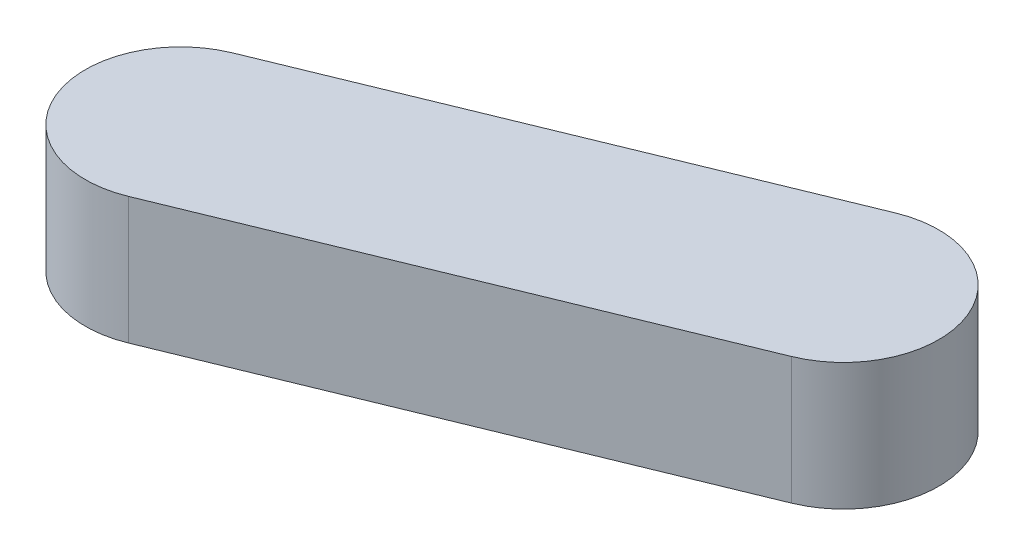
ISO-10303-21;
HEADER;
FILE_DESCRIPTION(('STEP AP214'),'2;1');
FILE_NAME('part.step','',(''),(''),'','','');
FILE_SCHEMA(('AUTOMOTIVE_DESIGN { 1 0 10303 214 1 1 1 1 }'));
ENDSEC;
DATA;
#1=APPLICATION_CONTEXT('core data for automotive mechanical design processes');
#2=APPLICATION_PROTOCOL_DEFINITION('international standard','automotive_design',2000,#1);
#3=PRODUCT_CONTEXT('',#1,'mechanical');
#4=PRODUCT('Part','Part','',(#3));
#5=PRODUCT_RELATED_PRODUCT_CATEGORY('part','',(#4));
#6=PRODUCT_DEFINITION_FORMATION('','',#4);
#7=PRODUCT_DEFINITION_CONTEXT('part definition',#1,'design');
#8=PRODUCT_DEFINITION('design','',#6,#7);
#9=PRODUCT_DEFINITION_SHAPE('','',#8);
#10=(LENGTH_UNIT() NAMED_UNIT(*) SI_UNIT(.MILLI.,.METRE.));
#11=(NAMED_UNIT(*) PLANE_ANGLE_UNIT() SI_UNIT($,.RADIAN.));
#12=(NAMED_UNIT(*) SI_UNIT($,.STERADIAN.) SOLID_ANGLE_UNIT());
#13=UNCERTAINTY_MEASURE_WITH_UNIT(LENGTH_MEASURE(1.E-05),#10,'distance_accuracy_value','');
#14=(GEOMETRIC_REPRESENTATION_CONTEXT(3) GLOBAL_UNCERTAINTY_ASSIGNED_CONTEXT((#13)) GLOBAL_UNIT_ASSIGNED_CONTEXT((#10,
#11,#12)) REPRESENTATION_CONTEXT('',''));
#15=CARTESIAN_POINT('',(0.,0.,0.));
#16=DIRECTION('',(0.,0.,1.));
#17=DIRECTION('',(1.,0.,0.));
#18=AXIS2_PLACEMENT_3D('',#15,#16,#17);
#19=CARTESIAN_POINT('',(-64.8838583492888,25.4,24.7131912757132));
#20=DIRECTION('',(0.,-1.,0.));
#21=DIRECTION('',(0.,0.,-1.));
#22=AXIS2_PLACEMENT_3D('',#19,#20,#21);
#23=CYLINDRICAL_SURFACE('',#22,19.05);
#24=CARTESIAN_POINT('',(-64.8838583492888,0.,24.7131912757132));
#25=DIRECTION('',(0.,1.,0.));
#26=DIRECTION('',(0.,0.,1.));
#27=AXIS2_PLACEMENT_3D('',#24,#25,#26);
#28=CIRCLE('',#27,19.05);
#29=CARTESIAN_POINT('',(-72.113575848851,0.,7.08838815974834));
#30=VERTEX_POINT('',#29);
#31=CARTESIAN_POINT('',(-57.6541408497266,0.,42.3379943916781));
#32=VERTEX_POINT('',#31);
#33=EDGE_CURVE('E96',#30,#32,#28,.T.);
#34=ORIENTED_EDGE('',*,*,#33,.T.);
#35=DIRECTION('',(0.,-1.,0.));
#36=VECTOR('',#35,1.);
#37=CARTESIAN_POINT('',(-57.6541408497266,25.4,42.3379943916781));
#38=LINE('',#37,#36);
#39=CARTESIAN_POINT('',(-57.6541408497266,25.4,42.3379943916781));
#40=VERTEX_POINT('',#39);
#41=EDGE_CURVE('E11',#40,#32,#38,.T.);
#42=ORIENTED_EDGE('',*,*,#41,.F.);
#43=CARTESIAN_POINT('',(-64.8838583492888,25.4,24.7131912757132));
#44=DIRECTION('',(0.,1.,0.));
#45=DIRECTION('',(0.,0.,1.));
#46=AXIS2_PLACEMENT_3D('',#43,#44,#45);
#47=CIRCLE('',#46,19.05);
#48=CARTESIAN_POINT('',(-72.113575848851,25.4,7.08838815974834));
#49=VERTEX_POINT('',#48);
#50=EDGE_CURVE('E84',#49,#40,#47,.T.);
#51=ORIENTED_EDGE('',*,*,#50,.F.);
#52=DIRECTION('',(0.,-1.,0.));
#53=VECTOR('',#52,1.);
#54=CARTESIAN_POINT('',(-72.113575848851,25.4,7.08838815974834));
#55=LINE('',#54,#53);
#56=EDGE_CURVE('E92',#49,#30,#55,.T.);
#57=ORIENTED_EDGE('',*,*,#56,.T.);
#58=EDGE_LOOP('',(#34,#42,#51,#57));
#59=FACE_BOUND('',#58,.T.);
#60=ADVANCED_FACE('F33',(#59),#23,.T.);
#61=CARTESIAN_POINT('',(-57.6541408497266,25.4,42.3379943916781));
#62=DIRECTION('',(-0.379512729635812,0.,-0.925186515273745));
#63=DIRECTION('',(-0.925186515273745,0.,0.379512729635812));
#64=AXIS2_PLACEMENT_3D('',#61,#62,#63);
#65=PLANE('',#64);
#66=DIRECTION('',(0.925186515273745,0.,-0.379512729635812));
#67=VECTOR('',#66,1.);
#68=CARTESIAN_POINT('',(-57.6541408497266,0.,42.3379943916781));
#69=LINE('',#68,#67);
#70=CARTESIAN_POINT('',(36.3448091020859,0.,3.77950106067955));
#71=VERTEX_POINT('',#70);
#72=EDGE_CURVE('E88',#32,#71,#69,.T.);
#73=ORIENTED_EDGE('',*,*,#72,.T.);
#74=DIRECTION('',(0.,-1.,0.));
#75=VECTOR('',#74,1.);
#76=CARTESIAN_POINT('',(36.3448091020859,25.4,3.77950106067955));
#77=LINE('',#76,#75);
#78=CARTESIAN_POINT('',(36.3448091020859,25.4,3.77950106067955));
#79=VERTEX_POINT('',#78);
#80=EDGE_CURVE('E41',#79,#71,#77,.T.);
#81=ORIENTED_EDGE('',*,*,#80,.F.);
#82=DIRECTION('',(0.925186515273745,0.,-0.379512729635812));
#83=VECTOR('',#82,1.);
#84=CARTESIAN_POINT('',(-57.6541408497266,25.4,42.3379943916781));
#85=LINE('',#84,#83);
#86=EDGE_CURVE('E79',#40,#79,#85,.T.);
#87=ORIENTED_EDGE('',*,*,#86,.F.);
#88=ORIENTED_EDGE('',*,*,#41,.T.);
#89=EDGE_LOOP('',(#73,#81,#87,#88));
#90=FACE_BOUND('',#89,.T.);
#91=ADVANCED_FACE('F87',(#90),#65,.F.);
#92=CARTESIAN_POINT('',(29.1150916025237,25.4,-13.8453020552853));
#93=DIRECTION('',(0.,-1.,0.));
#94=DIRECTION('',(0.,0.,-1.));
#95=AXIS2_PLACEMENT_3D('',#92,#93,#94);
#96=CYLINDRICAL_SURFACE('',#95,19.05);
#97=CARTESIAN_POINT('',(29.1150916025237,0.,-13.8453020552853));
#98=DIRECTION('',(0.,1.,0.));
#99=DIRECTION('',(0.,0.,1.));
#100=AXIS2_PLACEMENT_3D('',#97,#98,#99);
#101=CIRCLE('',#100,19.05);
#102=CARTESIAN_POINT('',(21.8853741029615,0.,-31.4701051712502));
#103=VERTEX_POINT('',#102);
#104=EDGE_CURVE('E66',#71,#103,#101,.T.);
#105=ORIENTED_EDGE('',*,*,#104,.T.);
#106=DIRECTION('',(0.,-1.,0.));
#107=VECTOR('',#106,1.);
#108=CARTESIAN_POINT('',(21.8853741029615,25.4,-31.4701051712502));
#109=LINE('',#108,#107);
#110=CARTESIAN_POINT('',(21.8853741029615,25.4,-31.4701051712502));
#111=VERTEX_POINT('',#110);
#112=EDGE_CURVE('E89',#111,#103,#109,.T.);
#113=ORIENTED_EDGE('',*,*,#112,.F.);
#114=CARTESIAN_POINT('',(29.1150916025237,25.4,-13.8453020552853));
#115=DIRECTION('',(0.,1.,0.));
#116=DIRECTION('',(0.,0.,1.));
#117=AXIS2_PLACEMENT_3D('',#114,#115,#116);
#118=CIRCLE('',#117,19.05);
#119=EDGE_CURVE('E82',#79,#111,#118,.T.);
#120=ORIENTED_EDGE('',*,*,#119,.F.);
#121=ORIENTED_EDGE('',*,*,#80,.T.);
#122=EDGE_LOOP('',(#105,#113,#120,#121));
#123=FACE_BOUND('',#122,.T.);
#124=ADVANCED_FACE('F90',(#123),#96,.T.);
#125=CARTESIAN_POINT('',(-72.113575848851,25.4,7.08838815974834));
#126=DIRECTION('',(0.379512729635812,0.,0.925186515273745));
#127=DIRECTION('',(0.925186515273745,0.,-0.379512729635812));
#128=AXIS2_PLACEMENT_3D('',#125,#126,#127);
#129=PLANE('',#128);
#130=DIRECTION('',(-0.925186515273745,0.,0.379512729635812));
#131=VECTOR('',#130,1.);
#132=CARTESIAN_POINT('',(-72.113575848851,0.,7.08838815974834));
#133=LINE('',#132,#131);
#134=EDGE_CURVE('E72',#103,#30,#133,.T.);
#135=ORIENTED_EDGE('',*,*,#134,.T.);
#136=ORIENTED_EDGE('',*,*,#56,.F.);
#137=DIRECTION('',(-0.925186515273745,0.,0.379512729635812));
#138=VECTOR('',#137,1.);
#139=CARTESIAN_POINT('',(-72.113575848851,25.4,7.08838815974834));
#140=LINE('',#139,#138);
#141=EDGE_CURVE('E49',#111,#49,#140,.T.);
#142=ORIENTED_EDGE('',*,*,#141,.F.);
#143=ORIENTED_EDGE('',*,*,#112,.T.);
#144=EDGE_LOOP('',(#135,#136,#142,#143));
#145=FACE_BOUND('',#144,.T.);
#146=ADVANCED_FACE('F103',(#145),#129,.F.);
#147=CARTESIAN_POINT('',(-64.8838583492888,25.4,24.7131912757132));
#148=DIRECTION('',(0.,1.,0.));
#149=DIRECTION('',(0.,0.,1.));
#150=AXIS2_PLACEMENT_3D('',#147,#148,#149);
#151=PLANE('',#150);
#152=ORIENTED_EDGE('',*,*,#50,.T.);
#153=ORIENTED_EDGE('',*,*,#86,.T.);
#154=ORIENTED_EDGE('',*,*,#119,.T.);
#155=ORIENTED_EDGE('',*,*,#141,.T.);
#156=EDGE_LOOP('',(#152,#153,#154,#155));
#157=FACE_BOUND('',#156,.T.);
#158=ADVANCED_FACE('F80',(#157),#151,.T.);
#159=CARTESIAN_POINT('',(-64.8838583492888,0.,24.7131912757132));
#160=DIRECTION('',(0.,1.,0.));
#161=DIRECTION('',(0.,0.,1.));
#162=AXIS2_PLACEMENT_3D('',#159,#160,#161);
#163=PLANE('',#162);
#164=ORIENTED_EDGE('',*,*,#33,.F.);
#165=ORIENTED_EDGE('',*,*,#134,.F.);
#166=ORIENTED_EDGE('',*,*,#104,.F.);
#167=ORIENTED_EDGE('',*,*,#72,.F.);
#168=EDGE_LOOP('',(#164,#165,#166,#167));
#169=FACE_BOUND('',#168,.T.);
#170=ADVANCED_FACE('F106',(#169),#163,.F.);
#171=CLOSED_SHELL('',(#60,#91,#124,#146,#158,#170));
#172=MANIFOLD_SOLID_BREP('B2',#171);
#173=ADVANCED_BREP_SHAPE_REPRESENTATION('',(#18,#172),#14);
#174=SHAPE_DEFINITION_REPRESENTATION(#9,#173);
ENDSEC;
END-ISO-10303-21;
